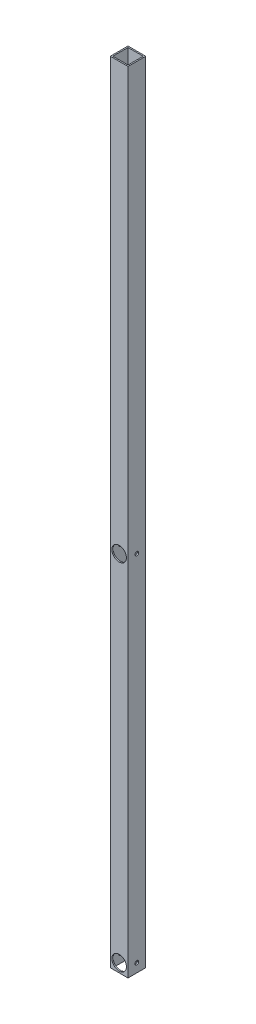
ISO-10303-21;
HEADER;
FILE_DESCRIPTION(('STEP AP214'),'2;1');
FILE_NAME('part.step','',(''),(''),'','','');
FILE_SCHEMA(('AUTOMOTIVE_DESIGN { 1 0 10303 214 1 1 1 1 }'));
ENDSEC;
DATA;
#1=APPLICATION_CONTEXT('core data for automotive mechanical design processes');
#2=APPLICATION_PROTOCOL_DEFINITION('international standard','automotive_design',2000,#1);
#3=PRODUCT_CONTEXT('',#1,'mechanical');
#4=PRODUCT('Part','Part','',(#3));
#5=PRODUCT_RELATED_PRODUCT_CATEGORY('part','',(#4));
#6=PRODUCT_DEFINITION_FORMATION('','',#4);
#7=PRODUCT_DEFINITION_CONTEXT('part definition',#1,'design');
#8=PRODUCT_DEFINITION('design','',#6,#7);
#9=PRODUCT_DEFINITION_SHAPE('','',#8);
#10=(LENGTH_UNIT() NAMED_UNIT(*) SI_UNIT(.MILLI.,.METRE.));
#11=(NAMED_UNIT(*) PLANE_ANGLE_UNIT() SI_UNIT($,.RADIAN.));
#12=(NAMED_UNIT(*) SI_UNIT($,.STERADIAN.) SOLID_ANGLE_UNIT());
#13=UNCERTAINTY_MEASURE_WITH_UNIT(LENGTH_MEASURE(1.E-05),#10,'distance_accuracy_value','');
#14=(GEOMETRIC_REPRESENTATION_CONTEXT(3) GLOBAL_UNCERTAINTY_ASSIGNED_CONTEXT((#13)) GLOBAL_UNIT_ASSIGNED_CONTEXT((#10,
#11,#12)) REPRESENTATION_CONTEXT('',''));
#15=CARTESIAN_POINT('',(0.,0.,0.));
#16=DIRECTION('',(0.,0.,1.));
#17=DIRECTION('',(1.,0.,0.));
#18=AXIS2_PLACEMENT_3D('',#15,#16,#17);
#19=CARTESIAN_POINT('',(0.,1981.2,0.));
#20=DIRECTION('',(0.,-1.,0.));
#21=DIRECTION('',(0.,0.,-1.));
#22=AXIS2_PLACEMENT_3D('',#19,#20,#21);
#23=PLANE('',#22);
#24=DIRECTION('',(0.,0.,1.));
#25=VECTOR('',#24,1.);
#26=CARTESIAN_POINT('',(0.,1981.2,0.));
#27=LINE('',#26,#25);
#28=CARTESIAN_POINT('',(0.,1981.2,-44.45));
#29=VERTEX_POINT('',#28);
#30=CARTESIAN_POINT('',(0.,1981.2,0.));
#31=VERTEX_POINT('',#30);
#32=EDGE_CURVE('E139',#29,#31,#27,.T.);
#33=ORIENTED_EDGE('',*,*,#32,.T.);
#34=DIRECTION('',(1.,0.,0.));
#35=VECTOR('',#34,1.);
#36=CARTESIAN_POINT('',(0.,1981.2,0.));
#37=LINE('',#36,#35);
#38=CARTESIAN_POINT('',(44.45,1981.2,0.));
#39=VERTEX_POINT('',#38);
#40=EDGE_CURVE('E142',#31,#39,#37,.T.);
#41=ORIENTED_EDGE('',*,*,#40,.T.);
#42=DIRECTION('',(0.,0.,-1.));
#43=VECTOR('',#42,1.);
#44=CARTESIAN_POINT('',(44.45,1981.2,0.));
#45=LINE('',#44,#43);
#46=CARTESIAN_POINT('',(44.45,1981.2,-44.45));
#47=VERTEX_POINT('',#46);
#48=EDGE_CURVE('E145',#39,#47,#45,.T.);
#49=ORIENTED_EDGE('',*,*,#48,.T.);
#50=DIRECTION('',(-1.,0.,0.));
#51=VECTOR('',#50,1.);
#52=CARTESIAN_POINT('',(0.,1981.2,-44.45));
#53=LINE('',#52,#51);
#54=EDGE_CURVE('E147',#47,#29,#53,.T.);
#55=ORIENTED_EDGE('',*,*,#54,.T.);
#56=EDGE_LOOP('',(#33,#41,#49,#55));
#57=FACE_BOUND('',#56,.T.);
#58=DIRECTION('',(1.,0.,0.));
#59=VECTOR('',#58,1.);
#60=CARTESIAN_POINT('',(3.175,1981.2,-3.175));
#61=LINE('',#60,#59);
#62=CARTESIAN_POINT('',(3.175,1981.2,-3.175));
#63=VERTEX_POINT('',#62);
#64=CARTESIAN_POINT('',(41.275,1981.2,-3.175));
#65=VERTEX_POINT('',#64);
#66=EDGE_CURVE('E101',#63,#65,#61,.T.);
#67=ORIENTED_EDGE('',*,*,#66,.F.);
#68=DIRECTION('',(0.,0.,1.));
#69=VECTOR('',#68,1.);
#70=CARTESIAN_POINT('',(3.175,1981.2,-3.175));
#71=LINE('',#70,#69);
#72=CARTESIAN_POINT('',(3.175,1981.2,-41.275));
#73=VERTEX_POINT('',#72);
#74=EDGE_CURVE('E123',#73,#63,#71,.T.);
#75=ORIENTED_EDGE('',*,*,#74,.F.);
#76=DIRECTION('',(-1.,0.,0.));
#77=VECTOR('',#76,1.);
#78=CARTESIAN_POINT('',(3.175,1981.2,-41.275));
#79=LINE('',#78,#77);
#80=CARTESIAN_POINT('',(41.275,1981.2,-41.275));
#81=VERTEX_POINT('',#80);
#82=EDGE_CURVE('E121',#81,#73,#79,.T.);
#83=ORIENTED_EDGE('',*,*,#82,.F.);
#84=DIRECTION('',(0.,0.,-1.));
#85=VECTOR('',#84,1.);
#86=CARTESIAN_POINT('',(41.275,1981.2,-3.175));
#87=LINE('',#86,#85);
#88=EDGE_CURVE('E109',#65,#81,#87,.T.);
#89=ORIENTED_EDGE('',*,*,#88,.F.);
#90=EDGE_LOOP('',(#67,#75,#83,#89));
#91=FACE_BOUND('',#90,.T.);
#92=ADVANCED_FACE('F34',(#57,#91),#23,.F.);
#93=CARTESIAN_POINT('',(0.,0.,0.));
#94=DIRECTION('',(0.,-1.,0.));
#95=DIRECTION('',(0.,0.,-1.));
#96=AXIS2_PLACEMENT_3D('',#93,#94,#95);
#97=PLANE('',#96);
#98=DIRECTION('',(0.,0.,1.));
#99=VECTOR('',#98,1.);
#100=CARTESIAN_POINT('',(0.,0.,0.));
#101=LINE('',#100,#99);
#102=CARTESIAN_POINT('',(0.,0.,-44.45));
#103=VERTEX_POINT('',#102);
#104=CARTESIAN_POINT('',(0.,0.,0.));
#105=VERTEX_POINT('',#104);
#106=EDGE_CURVE('E117',#103,#105,#101,.T.);
#107=ORIENTED_EDGE('',*,*,#106,.F.);
#108=DIRECTION('',(-1.,0.,0.));
#109=VECTOR('',#108,1.);
#110=CARTESIAN_POINT('',(0.,0.,-44.45));
#111=LINE('',#110,#109);
#112=CARTESIAN_POINT('',(44.45,0.,-44.45));
#113=VERTEX_POINT('',#112);
#114=EDGE_CURVE('E143',#113,#103,#111,.T.);
#115=ORIENTED_EDGE('',*,*,#114,.F.);
#116=DIRECTION('',(0.,0.,-1.));
#117=VECTOR('',#116,1.);
#118=CARTESIAN_POINT('',(44.45,0.,0.));
#119=LINE('',#118,#117);
#120=CARTESIAN_POINT('',(44.45,0.,0.));
#121=VERTEX_POINT('',#120);
#122=EDGE_CURVE('E154',#121,#113,#119,.T.);
#123=ORIENTED_EDGE('',*,*,#122,.F.);
#124=DIRECTION('',(1.,0.,0.));
#125=VECTOR('',#124,1.);
#126=CARTESIAN_POINT('',(0.,0.,0.));
#127=LINE('',#126,#125);
#128=EDGE_CURVE('E152',#105,#121,#127,.T.);
#129=ORIENTED_EDGE('',*,*,#128,.F.);
#130=EDGE_LOOP('',(#107,#115,#123,#129));
#131=FACE_BOUND('',#130,.T.);
#132=DIRECTION('',(0.,0.,1.));
#133=VECTOR('',#132,1.);
#134=CARTESIAN_POINT('',(3.175,0.,-3.175));
#135=LINE('',#134,#133);
#136=CARTESIAN_POINT('',(3.175,0.,-41.275));
#137=VERTEX_POINT('',#136);
#138=CARTESIAN_POINT('',(3.175,0.,-3.175));
#139=VERTEX_POINT('',#138);
#140=EDGE_CURVE('E110',#137,#139,#135,.T.);
#141=ORIENTED_EDGE('',*,*,#140,.T.);
#142=DIRECTION('',(1.,0.,0.));
#143=VECTOR('',#142,1.);
#144=CARTESIAN_POINT('',(3.175,0.,-3.175));
#145=LINE('',#144,#143);
#146=CARTESIAN_POINT('',(41.275,0.,-3.175));
#147=VERTEX_POINT('',#146);
#148=EDGE_CURVE('E59',#139,#147,#145,.T.);
#149=ORIENTED_EDGE('',*,*,#148,.T.);
#150=DIRECTION('',(0.,0.,-1.));
#151=VECTOR('',#150,1.);
#152=CARTESIAN_POINT('',(41.275,0.,-3.175));
#153=LINE('',#152,#151);
#154=CARTESIAN_POINT('',(41.275,0.,-41.275));
#155=VERTEX_POINT('',#154);
#156=EDGE_CURVE('E116',#147,#155,#153,.T.);
#157=ORIENTED_EDGE('',*,*,#156,.T.);
#158=DIRECTION('',(-1.,0.,0.));
#159=VECTOR('',#158,1.);
#160=CARTESIAN_POINT('',(3.175,0.,-41.275));
#161=LINE('',#160,#159);
#162=EDGE_CURVE('E131',#155,#137,#161,.T.);
#163=ORIENTED_EDGE('',*,*,#162,.T.);
#164=EDGE_LOOP('',(#141,#149,#157,#163));
#165=FACE_BOUND('',#164,.T.);
#166=ADVANCED_FACE('F242',(#131,#165),#97,.T.);
#167=CARTESIAN_POINT('',(0.,1981.2,0.));
#168=DIRECTION('',(1.,0.,0.));
#169=DIRECTION('',(0.,0.,-1.));
#170=AXIS2_PLACEMENT_3D('',#167,#168,#169);
#171=PLANE('',#170);
#172=CARTESIAN_POINT('',(0.,22.225,-22.225));
#173=DIRECTION('',(1.,0.,0.));
#174=DIRECTION('',(0.,0.,-1.));
#175=AXIS2_PLACEMENT_3D('',#172,#173,#174);
#176=CIRCLE('',#175,4.7625);
#177=CARTESIAN_POINT('',(0.,22.225,-26.9875));
#178=VERTEX_POINT('',#177);
#179=EDGE_CURVE('E174',#178,#178,#176,.T.);
#180=ORIENTED_EDGE('',*,*,#179,.T.);
#181=EDGE_LOOP('',(#180));
#182=FACE_BOUND('',#181,.T.);
#183=CARTESIAN_POINT('',(0.,911.225,-22.225));
#184=DIRECTION('',(1.,0.,0.));
#185=DIRECTION('',(0.,0.,-1.));
#186=AXIS2_PLACEMENT_3D('',#183,#184,#185);
#187=CIRCLE('',#186,4.76250000000002);
#188=CARTESIAN_POINT('',(0.,911.225,-26.9875));
#189=VERTEX_POINT('',#188);
#190=EDGE_CURVE('E185',#189,#189,#187,.T.);
#191=ORIENTED_EDGE('',*,*,#190,.T.);
#192=EDGE_LOOP('',(#191));
#193=FACE_BOUND('',#192,.T.);
#194=ORIENTED_EDGE('',*,*,#106,.T.);
#195=DIRECTION('',(0.,-1.,0.));
#196=VECTOR('',#195,1.);
#197=CARTESIAN_POINT('',(0.,1981.2,0.));
#198=LINE('',#197,#196);
#199=EDGE_CURVE('E11',#31,#105,#198,.T.);
#200=ORIENTED_EDGE('',*,*,#199,.F.);
#201=ORIENTED_EDGE('',*,*,#32,.F.);
#202=DIRECTION('',(0.,-1.,0.));
#203=VECTOR('',#202,1.);
#204=CARTESIAN_POINT('',(0.,1981.2,-44.45));
#205=LINE('',#204,#203);
#206=EDGE_CURVE('E149',#29,#103,#205,.T.);
#207=ORIENTED_EDGE('',*,*,#206,.T.);
#208=EDGE_LOOP('',(#194,#200,#201,#207));
#209=FACE_BOUND('',#208,.T.);
#210=ADVANCED_FACE('F36',(#182,#193,#209),#171,.F.);
#211=CARTESIAN_POINT('',(0.,1981.2,0.));
#212=DIRECTION('',(0.,0.,-1.));
#213=DIRECTION('',(-1.,0.,0.));
#214=AXIS2_PLACEMENT_3D('',#211,#212,#213);
#215=PLANE('',#214);
#216=CARTESIAN_POINT('',(22.225,22.225,0.));
#217=DIRECTION('',(0.,0.,1.));
#218=DIRECTION('',(1.,0.,0.));
#219=AXIS2_PLACEMENT_3D('',#216,#217,#218);
#220=CIRCLE('',#219,18.25625);
#221=CARTESIAN_POINT('',(40.48125,22.225,0.));
#222=VERTEX_POINT('',#221);
#223=EDGE_CURVE('E199',#222,#222,#220,.T.);
#224=ORIENTED_EDGE('',*,*,#223,.F.);
#225=EDGE_LOOP('',(#224));
#226=FACE_BOUND('',#225,.T.);
#227=CARTESIAN_POINT('',(22.225,911.225,0.));
#228=DIRECTION('',(0.,0.,1.));
#229=DIRECTION('',(1.,0.,0.));
#230=AXIS2_PLACEMENT_3D('',#227,#228,#229);
#231=CIRCLE('',#230,18.25625);
#232=CARTESIAN_POINT('',(40.48125,911.225,0.));
#233=VERTEX_POINT('',#232);
#234=EDGE_CURVE('E196',#233,#233,#231,.T.);
#235=ORIENTED_EDGE('',*,*,#234,.F.);
#236=EDGE_LOOP('',(#235));
#237=FACE_BOUND('',#236,.T.);
#238=ORIENTED_EDGE('',*,*,#128,.T.);
#239=DIRECTION('',(0.,-1.,0.));
#240=VECTOR('',#239,1.);
#241=CARTESIAN_POINT('',(44.45,1981.2,0.));
#242=LINE('',#241,#240);
#243=EDGE_CURVE('E43',#39,#121,#242,.T.);
#244=ORIENTED_EDGE('',*,*,#243,.F.);
#245=ORIENTED_EDGE('',*,*,#40,.F.);
#246=ORIENTED_EDGE('',*,*,#199,.T.);
#247=EDGE_LOOP('',(#238,#244,#245,#246));
#248=FACE_BOUND('',#247,.T.);
#249=ADVANCED_FACE('F228',(#226,#237,#248),#215,.F.);
#250=CARTESIAN_POINT('',(44.45,1981.2,0.));
#251=DIRECTION('',(-1.,0.,0.));
#252=DIRECTION('',(0.,0.,1.));
#253=AXIS2_PLACEMENT_3D('',#250,#251,#252);
#254=PLANE('',#253);
#255=CARTESIAN_POINT('',(44.45,22.225,-22.225));
#256=DIRECTION('',(1.,0.,0.));
#257=DIRECTION('',(0.,0.,-1.));
#258=AXIS2_PLACEMENT_3D('',#255,#256,#257);
#259=CIRCLE('',#258,4.7625);
#260=CARTESIAN_POINT('',(44.45,22.225,-26.9875));
#261=VERTEX_POINT('',#260);
#262=EDGE_CURVE('E180',#261,#261,#259,.T.);
#263=ORIENTED_EDGE('',*,*,#262,.F.);
#264=EDGE_LOOP('',(#263));
#265=FACE_BOUND('',#264,.T.);
#266=CARTESIAN_POINT('',(44.45,911.225,-22.225));
#267=DIRECTION('',(1.,0.,0.));
#268=DIRECTION('',(0.,0.,-1.));
#269=AXIS2_PLACEMENT_3D('',#266,#267,#268);
#270=CIRCLE('',#269,4.76250000000002);
#271=CARTESIAN_POINT('',(44.45,911.225,-26.9875));
#272=VERTEX_POINT('',#271);
#273=EDGE_CURVE('E190',#272,#272,#270,.T.);
#274=ORIENTED_EDGE('',*,*,#273,.F.);
#275=EDGE_LOOP('',(#274));
#276=FACE_BOUND('',#275,.T.);
#277=ORIENTED_EDGE('',*,*,#122,.T.);
#278=DIRECTION('',(0.,-1.,0.));
#279=VECTOR('',#278,1.);
#280=CARTESIAN_POINT('',(44.45,1981.2,-44.45));
#281=LINE('',#280,#279);
#282=EDGE_CURVE('E159',#47,#113,#281,.T.);
#283=ORIENTED_EDGE('',*,*,#282,.F.);
#284=ORIENTED_EDGE('',*,*,#48,.F.);
#285=ORIENTED_EDGE('',*,*,#243,.T.);
#286=EDGE_LOOP('',(#277,#283,#284,#285));
#287=FACE_BOUND('',#286,.T.);
#288=ADVANCED_FACE('F231',(#265,#276,#287),#254,.F.);
#289=CARTESIAN_POINT('',(0.,1981.2,-44.45));
#290=DIRECTION('',(0.,0.,1.));
#291=DIRECTION('',(1.,0.,0.));
#292=AXIS2_PLACEMENT_3D('',#289,#290,#291);
#293=PLANE('',#292);
#294=CARTESIAN_POINT('',(22.225,22.225,-44.45));
#295=DIRECTION('',(0.,0.,1.));
#296=DIRECTION('',(1.,0.,0.));
#297=AXIS2_PLACEMENT_3D('',#294,#295,#296);
#298=CIRCLE('',#297,18.25625);
#299=CARTESIAN_POINT('',(40.48125,22.225,-44.45));
#300=VERTEX_POINT('',#299);
#301=EDGE_CURVE('E168',#300,#300,#298,.T.);
#302=ORIENTED_EDGE('',*,*,#301,.T.);
#303=EDGE_LOOP('',(#302));
#304=FACE_BOUND('',#303,.T.);
#305=CARTESIAN_POINT('',(22.225,911.225,-44.45));
#306=DIRECTION('',(0.,0.,1.));
#307=DIRECTION('',(1.,0.,0.));
#308=AXIS2_PLACEMENT_3D('',#305,#306,#307);
#309=CIRCLE('',#308,18.25625);
#310=CARTESIAN_POINT('',(40.48125,911.225,-44.45));
#311=VERTEX_POINT('',#310);
#312=EDGE_CURVE('E202',#311,#311,#309,.T.);
#313=ORIENTED_EDGE('',*,*,#312,.T.);
#314=EDGE_LOOP('',(#313));
#315=FACE_BOUND('',#314,.T.);
#316=ORIENTED_EDGE('',*,*,#114,.T.);
#317=ORIENTED_EDGE('',*,*,#206,.F.);
#318=ORIENTED_EDGE('',*,*,#54,.F.);
#319=ORIENTED_EDGE('',*,*,#282,.T.);
#320=EDGE_LOOP('',(#316,#317,#318,#319));
#321=FACE_BOUND('',#320,.T.);
#322=ADVANCED_FACE('F216',(#304,#315,#321),#293,.F.);
#323=CARTESIAN_POINT('',(3.175,1981.2,-3.175));
#324=DIRECTION('',(0.,0.,-1.));
#325=DIRECTION('',(-1.,0.,0.));
#326=AXIS2_PLACEMENT_3D('',#323,#324,#325);
#327=PLANE('',#326);
#328=CARTESIAN_POINT('',(22.225,22.225,-3.175));
#329=DIRECTION('',(0.,0.,-1.));
#330=DIRECTION('',(-1.,0.,0.));
#331=AXIS2_PLACEMENT_3D('',#328,#329,#330);
#332=CIRCLE('',#331,18.25625);
#333=CARTESIAN_POINT('',(3.96875,22.225,-3.175));
#334=VERTEX_POINT('',#333);
#335=EDGE_CURVE('E129',#334,#334,#332,.T.);
#336=ORIENTED_EDGE('',*,*,#335,.F.);
#337=EDGE_LOOP('',(#336));
#338=FACE_BOUND('',#337,.T.);
#339=CARTESIAN_POINT('',(22.225,911.225,-3.175));
#340=DIRECTION('',(0.,0.,-1.));
#341=DIRECTION('',(-1.,0.,0.));
#342=AXIS2_PLACEMENT_3D('',#339,#340,#341);
#343=CIRCLE('',#342,18.25625);
#344=CARTESIAN_POINT('',(3.96875,911.225,-3.175));
#345=VERTEX_POINT('',#344);
#346=EDGE_CURVE('E167',#345,#345,#343,.T.);
#347=ORIENTED_EDGE('',*,*,#346,.F.);
#348=EDGE_LOOP('',(#347));
#349=FACE_BOUND('',#348,.T.);
#350=ORIENTED_EDGE('',*,*,#148,.F.);
#351=DIRECTION('',(0.,-1.,0.));
#352=VECTOR('',#351,1.);
#353=CARTESIAN_POINT('',(3.175,1981.2,-3.175));
#354=LINE('',#353,#352);
#355=EDGE_CURVE('E105',#63,#139,#354,.T.);
#356=ORIENTED_EDGE('',*,*,#355,.F.);
#357=ORIENTED_EDGE('',*,*,#66,.T.);
#358=DIRECTION('',(0.,-1.,0.));
#359=VECTOR('',#358,1.);
#360=CARTESIAN_POINT('',(41.275,1981.2,-3.175));
#361=LINE('',#360,#359);
#362=EDGE_CURVE('E104',#65,#147,#361,.T.);
#363=ORIENTED_EDGE('',*,*,#362,.T.);
#364=EDGE_LOOP('',(#350,#356,#357,#363));
#365=FACE_BOUND('',#364,.T.);
#366=ADVANCED_FACE('F103',(#338,#349,#365),#327,.T.);
#367=CARTESIAN_POINT('',(41.275,1981.2,-3.175));
#368=DIRECTION('',(-1.,0.,0.));
#369=DIRECTION('',(0.,0.,1.));
#370=AXIS2_PLACEMENT_3D('',#367,#368,#369);
#371=PLANE('',#370);
#372=CARTESIAN_POINT('',(41.275,22.225,-22.225));
#373=DIRECTION('',(-1.,0.,0.));
#374=DIRECTION('',(0.,0.,1.));
#375=AXIS2_PLACEMENT_3D('',#372,#373,#374);
#376=CIRCLE('',#375,4.7625);
#377=CARTESIAN_POINT('',(41.275,22.225,-17.4625));
#378=VERTEX_POINT('',#377);
#379=EDGE_CURVE('E193',#378,#378,#376,.T.);
#380=ORIENTED_EDGE('',*,*,#379,.F.);
#381=EDGE_LOOP('',(#380));
#382=FACE_BOUND('',#381,.T.);
#383=CARTESIAN_POINT('',(41.275,911.225,-22.225));
#384=DIRECTION('',(-1.,0.,0.));
#385=DIRECTION('',(0.,0.,1.));
#386=AXIS2_PLACEMENT_3D('',#383,#384,#385);
#387=CIRCLE('',#386,4.76250000000002);
#388=CARTESIAN_POINT('',(41.275,911.225,-17.4625));
#389=VERTEX_POINT('',#388);
#390=EDGE_CURVE('E173',#389,#389,#387,.T.);
#391=ORIENTED_EDGE('',*,*,#390,.F.);
#392=EDGE_LOOP('',(#391));
#393=FACE_BOUND('',#392,.T.);
#394=ORIENTED_EDGE('',*,*,#156,.F.);
#395=ORIENTED_EDGE('',*,*,#362,.F.);
#396=ORIENTED_EDGE('',*,*,#88,.T.);
#397=DIRECTION('',(0.,-1.,0.));
#398=VECTOR('',#397,1.);
#399=CARTESIAN_POINT('',(41.275,1981.2,-41.275));
#400=LINE('',#399,#398);
#401=EDGE_CURVE('E118',#81,#155,#400,.T.);
#402=ORIENTED_EDGE('',*,*,#401,.T.);
#403=EDGE_LOOP('',(#394,#395,#396,#402));
#404=FACE_BOUND('',#403,.T.);
#405=ADVANCED_FACE('F113',(#382,#393,#404),#371,.T.);
#406=CARTESIAN_POINT('',(3.175,1981.2,-41.275));
#407=DIRECTION('',(0.,0.,1.));
#408=DIRECTION('',(1.,0.,0.));
#409=AXIS2_PLACEMENT_3D('',#406,#407,#408);
#410=PLANE('',#409);
#411=CARTESIAN_POINT('',(22.225,22.225,-41.275));
#412=DIRECTION('',(0.,0.,1.));
#413=DIRECTION('',(1.,0.,0.));
#414=AXIS2_PLACEMENT_3D('',#411,#412,#413);
#415=CIRCLE('',#414,18.25625);
#416=CARTESIAN_POINT('',(40.48125,22.225,-41.275));
#417=VERTEX_POINT('',#416);
#418=EDGE_CURVE('E169',#417,#417,#415,.T.);
#419=ORIENTED_EDGE('',*,*,#418,.F.);
#420=EDGE_LOOP('',(#419));
#421=FACE_BOUND('',#420,.T.);
#422=CARTESIAN_POINT('',(22.225,911.225,-41.275));
#423=DIRECTION('',(0.,0.,1.));
#424=DIRECTION('',(1.,0.,0.));
#425=AXIS2_PLACEMENT_3D('',#422,#423,#424);
#426=CIRCLE('',#425,18.25625);
#427=CARTESIAN_POINT('',(40.48125,911.225,-41.275));
#428=VERTEX_POINT('',#427);
#429=EDGE_CURVE('E164',#428,#428,#426,.T.);
#430=ORIENTED_EDGE('',*,*,#429,.F.);
#431=EDGE_LOOP('',(#430));
#432=FACE_BOUND('',#431,.T.);
#433=ORIENTED_EDGE('',*,*,#162,.F.);
#434=ORIENTED_EDGE('',*,*,#401,.F.);
#435=ORIENTED_EDGE('',*,*,#82,.T.);
#436=DIRECTION('',(0.,-1.,0.));
#437=VECTOR('',#436,1.);
#438=CARTESIAN_POINT('',(3.175,1981.2,-41.275));
#439=LINE('',#438,#437);
#440=EDGE_CURVE('E51',#73,#137,#439,.T.);
#441=ORIENTED_EDGE('',*,*,#440,.T.);
#442=EDGE_LOOP('',(#433,#434,#435,#441));
#443=FACE_BOUND('',#442,.T.);
#444=ADVANCED_FACE('F323',(#421,#432,#443),#410,.T.);
#445=CARTESIAN_POINT('',(3.175,1981.2,-3.175));
#446=DIRECTION('',(1.,0.,0.));
#447=DIRECTION('',(0.,0.,-1.));
#448=AXIS2_PLACEMENT_3D('',#445,#446,#447);
#449=PLANE('',#448);
#450=CARTESIAN_POINT('',(3.175,22.225,-22.225));
#451=DIRECTION('',(1.,0.,0.));
#452=DIRECTION('',(0.,0.,-1.));
#453=AXIS2_PLACEMENT_3D('',#450,#451,#452);
#454=CIRCLE('',#453,4.7625);
#455=CARTESIAN_POINT('',(3.175,22.225,-26.9875));
#456=VERTEX_POINT('',#455);
#457=EDGE_CURVE('E38',#456,#456,#454,.T.);
#458=ORIENTED_EDGE('',*,*,#457,.F.);
#459=EDGE_LOOP('',(#458));
#460=FACE_BOUND('',#459,.T.);
#461=CARTESIAN_POINT('',(3.175,911.225,-22.225));
#462=DIRECTION('',(1.,0.,0.));
#463=DIRECTION('',(0.,0.,-1.));
#464=AXIS2_PLACEMENT_3D('',#461,#462,#463);
#465=CIRCLE('',#464,4.76250000000002);
#466=CARTESIAN_POINT('',(3.175,911.225,-26.9875));
#467=VERTEX_POINT('',#466);
#468=EDGE_CURVE('E171',#467,#467,#465,.T.);
#469=ORIENTED_EDGE('',*,*,#468,.F.);
#470=EDGE_LOOP('',(#469));
#471=FACE_BOUND('',#470,.T.);
#472=ORIENTED_EDGE('',*,*,#140,.F.);
#473=ORIENTED_EDGE('',*,*,#440,.F.);
#474=ORIENTED_EDGE('',*,*,#74,.T.);
#475=ORIENTED_EDGE('',*,*,#355,.T.);
#476=EDGE_LOOP('',(#472,#473,#474,#475));
#477=FACE_BOUND('',#476,.T.);
#478=ADVANCED_FACE('F328',(#460,#471,#477),#449,.T.);
#479=CARTESIAN_POINT('',(22.225,911.225,-44.45));
#480=DIRECTION('',(0.,0.,1.));
#481=DIRECTION('',(1.,0.,0.));
#482=AXIS2_PLACEMENT_3D('',#479,#480,#481);
#483=CYLINDRICAL_SURFACE('',#482,18.25625);
#484=ORIENTED_EDGE('',*,*,#429,.T.);
#485=EDGE_LOOP('',(#484));
#486=FACE_BOUND('',#485,.T.);
#487=ORIENTED_EDGE('',*,*,#312,.F.);
#488=EDGE_LOOP('',(#487));
#489=FACE_BOUND('',#488,.T.);
#490=ADVANCED_FACE('F225',(#486,#489),#483,.F.);
#491=CARTESIAN_POINT('',(22.225,22.225,-44.45));
#492=DIRECTION('',(0.,0.,1.));
#493=DIRECTION('',(1.,0.,0.));
#494=AXIS2_PLACEMENT_3D('',#491,#492,#493);
#495=CYLINDRICAL_SURFACE('',#494,18.25625);
#496=ORIENTED_EDGE('',*,*,#418,.T.);
#497=EDGE_LOOP('',(#496));
#498=FACE_BOUND('',#497,.T.);
#499=ORIENTED_EDGE('',*,*,#301,.F.);
#500=EDGE_LOOP('',(#499));
#501=FACE_BOUND('',#500,.T.);
#502=ADVANCED_FACE('F223',(#498,#501),#495,.F.);
#503=ORIENTED_EDGE('',*,*,#346,.T.);
#504=EDGE_LOOP('',(#503));
#505=FACE_BOUND('',#504,.T.);
#506=ORIENTED_EDGE('',*,*,#234,.T.);
#507=EDGE_LOOP('',(#506));
#508=FACE_BOUND('',#507,.T.);
#509=ADVANCED_FACE('F220',(#505,#508),#483,.F.);
#510=ORIENTED_EDGE('',*,*,#335,.T.);
#511=EDGE_LOOP('',(#510));
#512=FACE_BOUND('',#511,.T.);
#513=ORIENTED_EDGE('',*,*,#223,.T.);
#514=EDGE_LOOP('',(#513));
#515=FACE_BOUND('',#514,.T.);
#516=ADVANCED_FACE('F211',(#512,#515),#495,.F.);
#517=CARTESIAN_POINT('',(0.,911.225,-22.225));
#518=DIRECTION('',(1.,0.,0.));
#519=DIRECTION('',(0.,0.,-1.));
#520=AXIS2_PLACEMENT_3D('',#517,#518,#519);
#521=CYLINDRICAL_SURFACE('',#520,4.76250000000002);
#522=ORIENTED_EDGE('',*,*,#468,.T.);
#523=EDGE_LOOP('',(#522));
#524=FACE_BOUND('',#523,.T.);
#525=ORIENTED_EDGE('',*,*,#190,.F.);
#526=EDGE_LOOP('',(#525));
#527=FACE_BOUND('',#526,.T.);
#528=ADVANCED_FACE('F275',(#524,#527),#521,.F.);
#529=CARTESIAN_POINT('',(0.,22.225,-22.225));
#530=DIRECTION('',(1.,0.,0.));
#531=DIRECTION('',(0.,0.,-1.));
#532=AXIS2_PLACEMENT_3D('',#529,#530,#531);
#533=CYLINDRICAL_SURFACE('',#532,4.7625);
#534=ORIENTED_EDGE('',*,*,#457,.T.);
#535=EDGE_LOOP('',(#534));
#536=FACE_BOUND('',#535,.T.);
#537=ORIENTED_EDGE('',*,*,#179,.F.);
#538=EDGE_LOOP('',(#537));
#539=FACE_BOUND('',#538,.T.);
#540=ADVANCED_FACE('F272',(#536,#539),#533,.F.);
#541=ORIENTED_EDGE('',*,*,#390,.T.);
#542=EDGE_LOOP('',(#541));
#543=FACE_BOUND('',#542,.T.);
#544=ORIENTED_EDGE('',*,*,#273,.T.);
#545=EDGE_LOOP('',(#544));
#546=FACE_BOUND('',#545,.T.);
#547=ADVANCED_FACE('F269',(#543,#546),#521,.F.);
#548=ORIENTED_EDGE('',*,*,#379,.T.);
#549=EDGE_LOOP('',(#548));
#550=FACE_BOUND('',#549,.T.);
#551=ORIENTED_EDGE('',*,*,#262,.T.);
#552=EDGE_LOOP('',(#551));
#553=FACE_BOUND('',#552,.T.);
#554=ADVANCED_FACE('F271',(#550,#553),#533,.F.);
#555=CLOSED_SHELL('',(#92,#166,#210,#249,#288,#322,#366,#405,#444,#478,#490,#502,#509,#516,#528,
#540,#547,#554));
#556=MANIFOLD_SOLID_BREP('B2',#555);
#557=ADVANCED_BREP_SHAPE_REPRESENTATION('',(#18,#556),#14);
#558=SHAPE_DEFINITION_REPRESENTATION(#9,#557);
ENDSEC;
END-ISO-10303-21;
